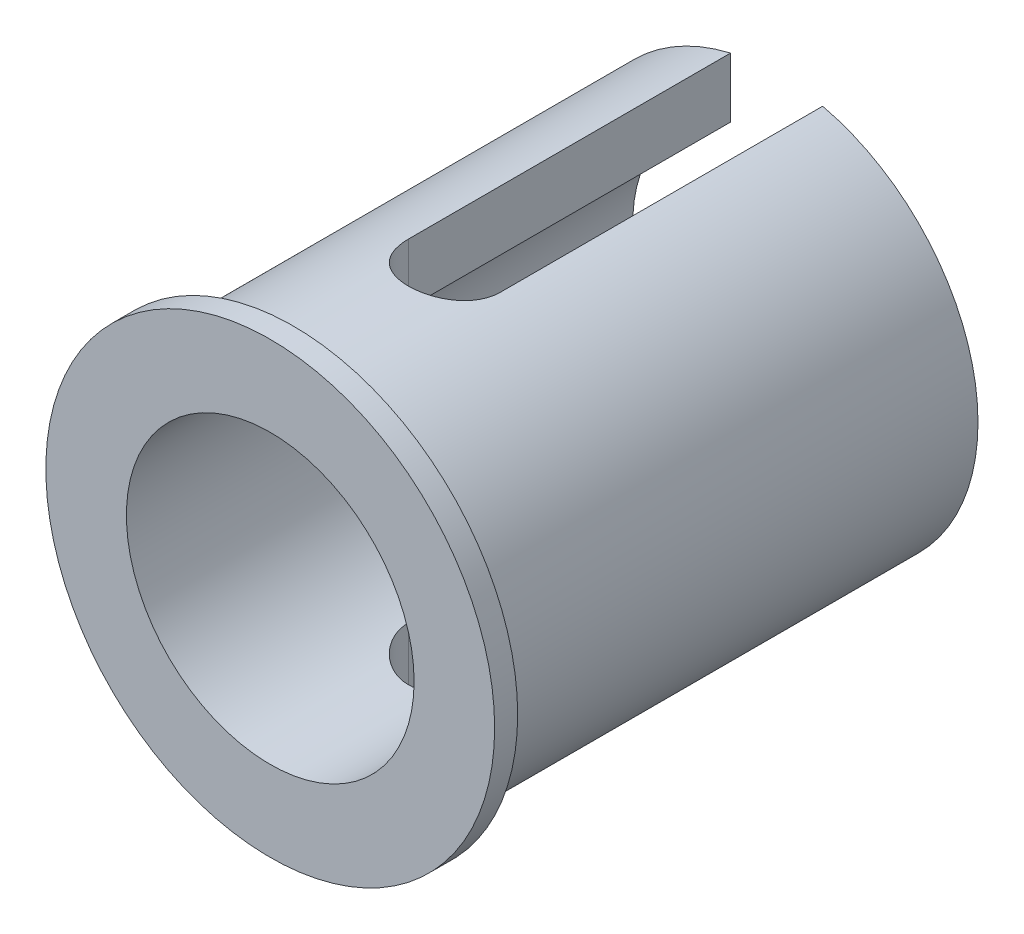
ISO-10303-21;
HEADER;
FILE_DESCRIPTION(('STEP AP214'),'2;1');
FILE_NAME('part.step','',(''),(''),'','','');
FILE_SCHEMA(('AUTOMOTIVE_DESIGN { 1 0 10303 214 1 1 1 1 }'));
ENDSEC;
DATA;
#1=APPLICATION_CONTEXT('core data for automotive mechanical design processes');
#2=APPLICATION_PROTOCOL_DEFINITION('international standard','automotive_design',2000,#1);
#3=PRODUCT_CONTEXT('',#1,'mechanical');
#4=PRODUCT('Part','Part','',(#3));
#5=PRODUCT_RELATED_PRODUCT_CATEGORY('part','',(#4));
#6=PRODUCT_DEFINITION_FORMATION('','',#4);
#7=PRODUCT_DEFINITION_CONTEXT('part definition',#1,'design');
#8=PRODUCT_DEFINITION('design','',#6,#7);
#9=PRODUCT_DEFINITION_SHAPE('','',#8);
#10=(LENGTH_UNIT() NAMED_UNIT(*) SI_UNIT(.MILLI.,.METRE.));
#11=(NAMED_UNIT(*) PLANE_ANGLE_UNIT() SI_UNIT($,.RADIAN.));
#12=(NAMED_UNIT(*) SI_UNIT($,.STERADIAN.) SOLID_ANGLE_UNIT());
#13=UNCERTAINTY_MEASURE_WITH_UNIT(LENGTH_MEASURE(1.E-05),#10,'distance_accuracy_value','');
#14=(GEOMETRIC_REPRESENTATION_CONTEXT(3) GLOBAL_UNCERTAINTY_ASSIGNED_CONTEXT((#13)) GLOBAL_UNIT_ASSIGNED_CONTEXT((#10,
#11,#12)) REPRESENTATION_CONTEXT('',''));
#15=CARTESIAN_POINT('',(0.,0.,0.));
#16=DIRECTION('',(0.,0.,1.));
#17=DIRECTION('',(1.,0.,0.));
#18=AXIS2_PLACEMENT_3D('',#15,#16,#17);
#19=CARTESIAN_POINT('',(0.,0.,-106.497474683058));
#20=DIRECTION('',(0.,0.,1.));
#21=DIRECTION('',(1.,0.,0.));
#22=AXIS2_PLACEMENT_3D('',#19,#20,#21);
#23=CYLINDRICAL_SURFACE('',#22,17.5);
#24=CARTESIAN_POINT('',(0.,0.,0.));
#25=DIRECTION('',(0.,0.,1.));
#26=DIRECTION('',(1.,0.,0.));
#27=AXIS2_PLACEMENT_3D('',#24,#25,#26);
#28=CIRCLE('',#27,17.5);
#29=CARTESIAN_POINT('',(17.5,0.,0.));
#30=VERTEX_POINT('',#29);
#31=EDGE_CURVE('E226',#30,#30,#28,.T.);
#32=ORIENTED_EDGE('',*,*,#31,.F.);
#33=EDGE_LOOP('',(#32));
#34=FACE_BOUND('',#33,.T.);
#35=CARTESIAN_POINT('',(4.,-17.0367250374008,-14.));
#36=CARTESIAN_POINT('',(4.00001248231752,-17.0367138660067,-13.8890681509802));
#37=CARTESIAN_POINT('',(3.99538546502867,-17.0378082617858,-13.7781434770407));
#38=CARTESIAN_POINT('',(3.97694932157873,-17.0421253952987,-13.5571174327618));
#39=CARTESIAN_POINT('',(3.96314155232038,-17.0453478185126,-13.4470159431883));
#40=CARTESIAN_POINT('',(3.92647318924765,-17.0538307536469,-13.2286052351257));
#41=CARTESIAN_POINT('',(3.90362864568809,-17.059087651771,-13.1202931917971));
#42=CARTESIAN_POINT('',(3.84909441070211,-17.0714746819689,-12.9060591164303));
#43=CARTESIAN_POINT('',(3.81740463706964,-17.0786048314525,-12.8001371066145));
#44=CARTESIAN_POINT('',(3.70940007909277,-17.1025105269156,-12.487064998065));
#45=CARTESIAN_POINT('',(3.6201165136919,-17.1218095761762,-12.2844107142015));
#46=CARTESIAN_POINT('',(3.40971418070429,-17.1649441397841,-11.8970188146421));
#47=CARTESIAN_POINT('',(3.28858925176469,-17.1887805318677,-11.7122846760033));
#48=CARTESIAN_POINT('',(3.01555269417647,-17.2387926899631,-11.3624938790227));
#49=CARTESIAN_POINT('',(2.8631677865296,-17.2650004661165,-11.1978105343623));
#50=CARTESIAN_POINT('',(2.53295238865314,-17.3165247611238,-10.8961004838254));
#51=CARTESIAN_POINT('',(2.35511790297881,-17.3418411392541,-10.759078128731));
#52=CARTESIAN_POINT('',(1.97651609742511,-17.3890809668325,-10.5150796799612));
#53=CARTESIAN_POINT('',(1.77550809318057,-17.410961949179,-10.4084680773347));
#54=CARTESIAN_POINT('',(1.35785483515843,-17.4484992744045,-10.2306870822243));
#55=CARTESIAN_POINT('',(1.14121231594596,-17.4641567027157,-10.1595115088972));
#56=CARTESIAN_POINT('',(0.702348968435731,-17.4872566687127,-10.0558050140799));
#57=CARTESIAN_POINT('',(0.480286158684646,-17.4948346770719,-10.0226360881499));
#58=CARTESIAN_POINT('',(0.0336222528298701,-17.5013922359856,-9.99388734164157));
#59=CARTESIAN_POINT('',(-0.19097858245641,-17.5003726621791,-9.99830369311109));
#60=CARTESIAN_POINT('',(-0.631926010215033,-17.489952340558,-10.0441310500121));
#61=CARTESIAN_POINT('',(-0.848348430712723,-17.4807076590668,-10.0848532048815));
#62=CARTESIAN_POINT('',(-1.27120201757732,-17.4550549045918,-10.2010359651051));
#63=CARTESIAN_POINT('',(-1.47763278775589,-17.4386465478123,-10.2764979467159));
#64=CARTESIAN_POINT('',(-1.87652973429281,-17.4002626903077,-10.460610280488));
#65=CARTESIAN_POINT('',(-2.06887311134545,-17.378244357821,-10.5695173599362));
#66=CARTESIAN_POINT('',(-2.43280009121923,-17.3310474587669,-10.8172430120138));
#67=CARTESIAN_POINT('',(-2.60438118822771,-17.3058685114888,-10.9560651895038));
#68=CARTESIAN_POINT('',(-2.92598580900956,-17.2544419046369,-11.2633581348487));
#69=CARTESIAN_POINT('',(-3.0754348941749,-17.2281829516239,-11.4324277375761));
#70=CARTESIAN_POINT('',(-3.34405202485233,-17.1780692090276,-11.7936653030108));
#71=CARTESIAN_POINT('',(-3.46321179425783,-17.1542150775981,-11.9858395576395));
#72=CARTESIAN_POINT('',(-3.61671597326182,-17.1222689727167,-12.2876218411558));
#73=CARTESIAN_POINT('',(-3.66376574815988,-17.1122387789592,-12.3907503245014));
#74=CARTESIAN_POINT('',(-3.7489839926838,-17.0937715302981,-12.6007382001695));
#75=CARTESIAN_POINT('',(-3.78715597297673,-17.0853338458964,-12.7075960984281));
#76=CARTESIAN_POINT('',(-3.8542742485837,-17.0703178704533,-12.9241673914184));
#77=CARTESIAN_POINT('',(-3.88323010403838,-17.0637376534167,-13.0338776985967));
#78=CARTESIAN_POINT('',(-3.93172314689819,-17.0526294698307,-13.2554190271487));
#79=CARTESIAN_POINT('',(-3.95126477595513,-17.0481005355421,-13.3672490225136));
#80=CARTESIAN_POINT('',(-3.97733749089981,-17.0420340571271,-13.5659970748536));
#81=CARTESIAN_POINT('',(-3.98583914323426,-17.0400453891908,-13.6526484373145));
#82=CARTESIAN_POINT('',(-3.99716769798061,-17.0373899876292,-13.8261972970282));
#83=CARTESIAN_POINT('',(-4.00000396405785,-17.0367210727584,-13.9130941500369));
#84=CARTESIAN_POINT('',(-4.,-17.0367250374008,-14.));
#85=B_SPLINE_CURVE_WITH_KNOTS('',3,(#35,#36,#37,#38,#39,#40,#41,#42,#43,#44,#45,#46,#47,#48,#49,
#50,#51,#52,#53,#54,#55,#56,#57,#58,#59,#60,#61,#62,#63,#64,#65,#66,#67,#68,#69,#70,#71,#72,#73,
#74,#75,#76,#77,#78,#79,#80,#81,#82,#83,#84),.UNSPECIFIED.,.F.,.F.,(4,2,2,2,2,2,2,2,2,2,2,2,2,2,
2,2,2,2,2,2,2,2,2,2,4),(0.,0.332681247866697,0.665313336820848,0.997357270100383,
1.32940428944207,1.99290262989595,2.65652945292504,3.33106339250549,4.00570334664101,
4.68811868485082,5.37041495269124,6.0410817607265,6.71168026410032,7.36981967360707,
8.02798515827642,8.69133469760162,9.35476421731794,10.0331782060872,10.7117773626502,
11.0528239514451,11.3937354453644,11.7342921410369,12.0746880036043,12.3357711604052,
12.5964224446493),.UNSPECIFIED.);
#86=CARTESIAN_POINT('',(4.,-17.0367250374008,-14.));
#87=VERTEX_POINT('',#86);
#88=CARTESIAN_POINT('',(-4.,-17.0367250374008,-14.));
#89=VERTEX_POINT('',#88);
#90=EDGE_CURVE('E134',#87,#89,#85,.T.);
#91=ORIENTED_EDGE('',*,*,#90,.F.);
#92=DIRECTION('',(0.,0.,1.));
#93=VECTOR('',#92,1.);
#94=CARTESIAN_POINT('',(3.99999999999999,-17.0367250374008,-106.497474683058));
#95=LINE('',#94,#93);
#96=CARTESIAN_POINT('',(4.,-17.0367250374008,-42.));
#97=VERTEX_POINT('',#96);
#98=EDGE_CURVE('E166',#87,#97,#95,.F.);
#99=ORIENTED_EDGE('',*,*,#98,.T.);
#100=CARTESIAN_POINT('',(0.,0.,-42.));
#101=DIRECTION('',(0.,0.,1.));
#102=DIRECTION('',(1.,0.,0.));
#103=AXIS2_PLACEMENT_3D('',#100,#101,#102);
#104=CIRCLE('',#103,17.5);
#105=CARTESIAN_POINT('',(4.,17.0367250374008,-42.));
#106=VERTEX_POINT('',#105);
#107=EDGE_CURVE('E239',#106,#97,#104,.F.);
#108=ORIENTED_EDGE('',*,*,#107,.F.);
#109=DIRECTION('',(0.,0.,1.));
#110=VECTOR('',#109,1.);
#111=CARTESIAN_POINT('',(3.99999999999999,17.0367250374008,-106.497474683058));
#112=LINE('',#111,#110);
#113=CARTESIAN_POINT('',(4.,17.0367250374008,-14.));
#114=VERTEX_POINT('',#113);
#115=EDGE_CURVE('E163',#106,#114,#112,.T.);
#116=ORIENTED_EDGE('',*,*,#115,.T.);
#117=CARTESIAN_POINT('',(-4.,17.0367250374008,-14.));
#118=CARTESIAN_POINT('',(-4.00001248231751,17.0367138660067,-13.8890681509802));
#119=CARTESIAN_POINT('',(-3.99538546502866,17.0378082617858,-13.7781434770407));
#120=CARTESIAN_POINT('',(-3.97694932157872,17.0421253952987,-13.5571174327618));
#121=CARTESIAN_POINT('',(-3.96314155232038,17.0453478185126,-13.4470159431883));
#122=CARTESIAN_POINT('',(-3.92647318924765,17.0538307536469,-13.2286052351257));
#123=CARTESIAN_POINT('',(-3.90362864568808,17.059087651771,-13.1202931917971));
#124=CARTESIAN_POINT('',(-3.8490944107021,17.0714746819689,-12.9060591164303));
#125=CARTESIAN_POINT('',(-3.81740463706963,17.0786048314525,-12.8001371066145));
#126=CARTESIAN_POINT('',(-3.70940007909276,17.1025105269156,-12.487064998065));
#127=CARTESIAN_POINT('',(-3.6201165136919,17.1218095761762,-12.2844107142015));
#128=CARTESIAN_POINT('',(-3.40971418070428,17.1649441397841,-11.8970188146421));
#129=CARTESIAN_POINT('',(-3.28858925176468,17.1887805318677,-11.7122846760033));
#130=CARTESIAN_POINT('',(-3.01555269417646,17.2387926899631,-11.3624938790227));
#131=CARTESIAN_POINT('',(-2.86316778652959,17.2650004661165,-11.1978105343623));
#132=CARTESIAN_POINT('',(-2.53295238865313,17.3165247611238,-10.8961004838254));
#133=CARTESIAN_POINT('',(-2.3551179029788,17.3418411392541,-10.759078128731));
#134=CARTESIAN_POINT('',(-1.97651609742511,17.3890809668325,-10.5150796799612));
#135=CARTESIAN_POINT('',(-1.77550809318057,17.410961949179,-10.4084680773347));
#136=CARTESIAN_POINT('',(-1.35785483515842,17.4484992744045,-10.2306870822243));
#137=CARTESIAN_POINT('',(-1.14121231594595,17.4641567027157,-10.1595115088972));
#138=CARTESIAN_POINT('',(-0.702348968435724,17.4872566687127,-10.0558050140799));
#139=CARTESIAN_POINT('',(-0.480286158684639,17.4948346770719,-10.0226360881499));
#140=CARTESIAN_POINT('',(-0.0336222528298628,17.5013922359856,-9.99388734164157));
#141=CARTESIAN_POINT('',(0.190978582456418,17.5003726621791,-9.99830369311109));
#142=CARTESIAN_POINT('',(0.63192601021504,17.489952340558,-10.0441310500121));
#143=CARTESIAN_POINT('',(0.84834843071273,17.4807076590668,-10.0848532048815));
#144=CARTESIAN_POINT('',(1.27120201757733,17.4550549045918,-10.2010359651051));
#145=CARTESIAN_POINT('',(1.4776327877559,17.4386465478123,-10.2764979467159));
#146=CARTESIAN_POINT('',(1.87652973429282,17.4002626903077,-10.460610280488));
#147=CARTESIAN_POINT('',(2.06887311134545,17.378244357821,-10.5695173599362));
#148=CARTESIAN_POINT('',(2.43280009121924,17.3310474587669,-10.8172430120138));
#149=CARTESIAN_POINT('',(2.60438118822771,17.3058685114888,-10.9560651895038));
#150=CARTESIAN_POINT('',(2.92598580900957,17.2544419046369,-11.2633581348487));
#151=CARTESIAN_POINT('',(3.07543489417491,17.2281829516239,-11.4324277375761));
#152=CARTESIAN_POINT('',(3.34405202485233,17.1780692090276,-11.7936653030108));
#153=CARTESIAN_POINT('',(3.46321179425784,17.1542150775981,-11.9858395576395));
#154=CARTESIAN_POINT('',(3.61671597326183,17.1222689727167,-12.2876218411558));
#155=CARTESIAN_POINT('',(3.66376574815989,17.1122387789592,-12.3907503245014));
#156=CARTESIAN_POINT('',(3.74898399268381,17.0937715302981,-12.6007382001695));
#157=CARTESIAN_POINT('',(3.78715597297674,17.0853338458964,-12.7075960984281));
#158=CARTESIAN_POINT('',(3.85427424858371,17.0703178704533,-12.9241673914184));
#159=CARTESIAN_POINT('',(3.88323010403838,17.0637376534167,-13.0338776985967));
#160=CARTESIAN_POINT('',(3.9317231468982,17.0526294698307,-13.2554190271487));
#161=CARTESIAN_POINT('',(3.95126477595514,17.0481005355421,-13.3672490225136));
#162=CARTESIAN_POINT('',(3.97733749089982,17.0420340571271,-13.5659970748536));
#163=CARTESIAN_POINT('',(3.98583914323427,17.0400453891908,-13.6526484373145));
#164=CARTESIAN_POINT('',(3.99716769798062,17.0373899876292,-13.8261972970282));
#165=CARTESIAN_POINT('',(4.00000396405785,17.0367210727584,-13.9130941500369));
#166=CARTESIAN_POINT('',(4.,17.0367250374008,-14.));
#167=B_SPLINE_CURVE_WITH_KNOTS('',3,(#117,#118,#119,#120,#121,#122,#123,#124,#125,#126,#127,
#128,#129,#130,#131,#132,#133,#134,#135,#136,#137,#138,#139,#140,#141,#142,#143,#144,#145,#146,
#147,#148,#149,#150,#151,#152,#153,#154,#155,#156,#157,#158,#159,#160,#161,#162,#163,#164,#165,
#166),.UNSPECIFIED.,.F.,.F.,(4,2,2,2,2,2,2,2,2,2,2,2,2,2,2,2,2,2,2,2,2,2,2,2,4),(0.,
0.332681247866697,0.66531333682085,0.997357270100387,1.32940428944207,1.99290262989595,
2.65652945292504,3.33106339250549,4.00570334664101,4.68811868485082,5.37041495269124,
6.0410817607265,6.71168026410032,7.36981967360707,8.02798515827642,8.69133469760162,
9.35476421731794,10.0331782060872,10.7117773626502,11.0528239514451,11.3937354453644,
11.7342921410368,12.0746880036043,12.3357711604052,12.5964224446493),.UNSPECIFIED.);
#168=CARTESIAN_POINT('',(-4.,17.0367250374008,-14.));
#169=VERTEX_POINT('',#168);
#170=EDGE_CURVE('E142',#169,#114,#167,.T.);
#171=ORIENTED_EDGE('',*,*,#170,.F.);
#172=DIRECTION('',(0.,0.,1.));
#173=VECTOR('',#172,1.);
#174=CARTESIAN_POINT('',(-4.00000000000001,17.0367250374008,-106.497474683058));
#175=LINE('',#174,#173);
#176=CARTESIAN_POINT('',(-4.,17.0367250374008,-42.));
#177=VERTEX_POINT('',#176);
#178=EDGE_CURVE('E155',#177,#169,#175,.T.);
#179=ORIENTED_EDGE('',*,*,#178,.F.);
#180=CARTESIAN_POINT('',(-4.,-17.0367250374008,-42.));
#181=VERTEX_POINT('',#180);
#182=EDGE_CURVE('E153',#181,#177,#104,.F.);
#183=ORIENTED_EDGE('',*,*,#182,.F.);
#184=DIRECTION('',(0.,0.,1.));
#185=VECTOR('',#184,1.);
#186=CARTESIAN_POINT('',(-4.00000000000001,-17.0367250374008,-106.497474683058));
#187=LINE('',#186,#185);
#188=EDGE_CURVE('E89',#89,#181,#187,.F.);
#189=ORIENTED_EDGE('',*,*,#188,.F.);
#190=EDGE_LOOP('',(#91,#99,#108,#116,#171,#179,#183,#189));
#191=FACE_BOUND('',#190,.T.);
#192=ADVANCED_FACE('F60',(#34,#191),#23,.T.);
#193=CARTESIAN_POINT('',(0.,0.,-106.497474683058));
#194=DIRECTION('',(0.,0.,1.));
#195=DIRECTION('',(1.,0.,0.));
#196=AXIS2_PLACEMENT_3D('',#193,#194,#195);
#197=CYLINDRICAL_SURFACE('',#196,12.5);
#198=CARTESIAN_POINT('',(0.,0.,2.));
#199=DIRECTION('',(0.,0.,1.));
#200=DIRECTION('',(1.,0.,0.));
#201=AXIS2_PLACEMENT_3D('',#198,#199,#200);
#202=CIRCLE('',#201,12.5);
#203=CARTESIAN_POINT('',(12.5,0.,2.));
#204=VERTEX_POINT('',#203);
#205=EDGE_CURVE('E228',#204,#204,#202,.T.);
#206=ORIENTED_EDGE('',*,*,#205,.T.);
#207=EDGE_LOOP('',(#206));
#208=FACE_BOUND('',#207,.T.);
#209=DIRECTION('',(0.,0.,1.));
#210=VECTOR('',#209,1.);
#211=CARTESIAN_POINT('',(3.99999999999999,-11.842719282327,-106.497474683058));
#212=LINE('',#211,#210);
#213=CARTESIAN_POINT('',(4.,-11.842719282327,-14.));
#214=VERTEX_POINT('',#213);
#215=CARTESIAN_POINT('',(4.,-11.842719282327,-42.));
#216=VERTEX_POINT('',#215);
#217=EDGE_CURVE('E157',#214,#216,#212,.F.);
#218=ORIENTED_EDGE('',*,*,#217,.F.);
#219=CARTESIAN_POINT('',(4.,-11.842719282327,-14.));
#220=CARTESIAN_POINT('',(4.00001410484614,-11.8427027366058,-13.8906002280384));
#221=CARTESIAN_POINT('',(3.995512175201,-11.8442348052368,-13.7812097901521));
#222=CARTESIAN_POINT('',(3.9775860667845,-11.8502730910574,-13.5632717592635));
#223=CARTESIAN_POINT('',(3.96416412872571,-11.8547785613244,-13.4547239615155));
#224=CARTESIAN_POINT('',(3.9285572511943,-11.8666242076309,-13.2395389691545));
#225=CARTESIAN_POINT('',(3.90639676021451,-11.8739564736691,-13.1328973043888));
#226=CARTESIAN_POINT('',(3.85353581488657,-11.8912164993788,-12.9219943616284));
#227=CARTESIAN_POINT('',(3.82283508754056,-11.90114434202,-12.8177331598432));
#228=CARTESIAN_POINT('',(3.71831764495513,-11.9343840843196,-12.5096949957216));
#229=CARTESIAN_POINT('',(3.63203544139888,-11.9611699822066,-12.310363447932));
#230=CARTESIAN_POINT('',(3.42895021192288,-12.0209583955878,-11.9289874429582));
#231=CARTESIAN_POINT('',(3.3121303092491,-12.0539643457894,-11.7469526209503));
#232=CARTESIAN_POINT('',(3.0467850788479,-12.123798407807,-11.3987460114008));
#233=CARTESIAN_POINT('',(2.89735303896515,-12.1607158548651,-11.2332816756605));
#234=CARTESIAN_POINT('',(2.57296449846116,-12.2334561140966,-10.9292851514111));
#235=CARTESIAN_POINT('',(2.39800356343233,-12.2692787347869,-10.7907576516423));
#236=CARTESIAN_POINT('',(2.02237003010512,-12.3368244653945,-10.5413848016295));
#237=CARTESIAN_POINT('',(1.82118394546976,-12.3684294972003,-10.4312780435304));
#238=CARTESIAN_POINT('',(1.40197197350369,-12.4229251649937,-10.2467505046506));
#239=CARTESIAN_POINT('',(1.18395091903581,-12.4458182908278,-10.1723195262181));
#240=CARTESIAN_POINT('',(0.744713961063367,-12.4796767811416,-10.0636411357495));
#241=CARTESIAN_POINT('',(0.523827920101157,-12.4910030499338,-10.0281750666199));
#242=CARTESIAN_POINT('',(0.07896481517464,-12.5017287122873,-9.99456720095836));
#243=CARTESIAN_POINT('',(-0.145011564197639,-12.5011307063103,-9.99641726647516));
#244=CARTESIAN_POINT('',(-0.581094974437689,-12.4883236673358,-10.0365988292713));
#245=CARTESIAN_POINT('',(-0.793338226675235,-12.4765355800409,-10.0736077679788));
#246=CARTESIAN_POINT('',(-1.2084232001272,-12.443194578958,-10.1808805516063));
#247=CARTESIAN_POINT('',(-1.41126440871778,-12.4216411334261,-10.2511462074328));
#248=CARTESIAN_POINT('',(-1.80478548808183,-12.3706364987475,-10.4237578422358));
#249=CARTESIAN_POINT('',(-1.99528012693527,-12.3410893067347,-10.5264965198688));
#250=CARTESIAN_POINT('',(-2.35673113106228,-12.2771965403044,-10.7608290490452));
#251=CARTESIAN_POINT('',(-2.5276825327575,-12.2428497517893,-10.892430206403));
#252=CARTESIAN_POINT('',(-2.8530451152822,-12.1712409097156,-11.1874465312916));
#253=CARTESIAN_POINT('',(-3.00641313381737,-12.1339170352569,-11.3519967025921));
#254=CARTESIAN_POINT('',(-3.28377291775701,-12.0618172896256,-11.7049719000853));
#255=CARTESIAN_POINT('',(-3.40775562728565,-12.0270422062066,-11.8934042588322));
#256=CARTESIAN_POINT('',(-3.56958208232606,-11.9796198433082,-12.1913712377486));
#257=CARTESIAN_POINT('',(-3.61975674493765,-11.9645161845072,-12.2939990592415));
#258=CARTESIAN_POINT('',(-3.71123075156255,-11.9364591580623,-12.5034047527517));
#259=CARTESIAN_POINT('',(-3.75253376401034,-11.9235049021446,-12.6101808877864));
#260=CARTESIAN_POINT('',(-3.82585831579178,-11.9001802342949,-12.8270133278916));
#261=CARTESIAN_POINT('',(-3.85788979915528,-11.889807055759,-12.9370659779731));
#262=CARTESIAN_POINT('',(-3.91241790563964,-11.8719756673203,-13.1596951569476));
#263=CARTESIAN_POINT('',(-3.93491889994975,-11.8645161211931,-13.2722705037974));
#264=CARTESIAN_POINT('',(-3.96832908530803,-11.8533815888388,-13.487239245861));
#265=CARTESIAN_POINT('',(-3.9802038456482,-11.8493925948395,-13.5894674157946));
#266=CARTESIAN_POINT('',(-3.9960393712768,-11.8440568016292,-13.7944610780333));
#267=CARTESIAN_POINT('',(-4.00001099551563,-11.8427063770563,-13.8972256382805));
#268=CARTESIAN_POINT('',(-4.,-11.842719282327,-14.));
#269=B_SPLINE_CURVE_WITH_KNOTS('',3,(#219,#220,#221,#222,#223,#224,#225,#226,#227,#228,#229,
#230,#231,#232,#233,#234,#235,#236,#237,#238,#239,#240,#241,#242,#243,#244,#245,#246,#247,#248,
#249,#250,#251,#252,#253,#254,#255,#256,#257,#258,#259,#260,#261,#262,#263,#264,#265,#266,#267,
#268),.UNSPECIFIED.,.F.,.F.,(4,2,2,2,2,2,2,2,2,2,2,2,2,2,2,2,2,2,2,2,2,2,2,2,4),(0.,
0.328080176984102,0.656077971124948,0.983164539368218,1.310261564488,1.96355293984248,
2.61720612481382,3.29209427898756,3.96709980211697,4.65819584662374,5.34909422856993,
6.01770820975086,6.68617638029994,7.3304550155383,7.97476873730065,8.62719320105811,
9.27978300073407,9.96076419384898,10.6419549776068,10.9872862883783,11.3324745283028,
11.6772911585126,12.0219494657669,12.3305938648259,12.6388138912331),.UNSPECIFIED.);
#270=CARTESIAN_POINT('',(-4.,-11.842719282327,-14.));
#271=VERTEX_POINT('',#270);
#272=EDGE_CURVE('E14',#214,#271,#269,.T.);
#273=ORIENTED_EDGE('',*,*,#272,.T.);
#274=DIRECTION('',(0.,0.,1.));
#275=VECTOR('',#274,1.);
#276=CARTESIAN_POINT('',(-4.00000000000001,-11.842719282327,-106.497474683058));
#277=LINE('',#276,#275);
#278=CARTESIAN_POINT('',(-4.,-11.842719282327,-42.));
#279=VERTEX_POINT('',#278);
#280=EDGE_CURVE('E146',#271,#279,#277,.F.);
#281=ORIENTED_EDGE('',*,*,#280,.T.);
#282=CARTESIAN_POINT('',(0.,0.,-42.));
#283=DIRECTION('',(0.,0.,1.));
#284=DIRECTION('',(1.,0.,0.));
#285=AXIS2_PLACEMENT_3D('',#282,#283,#284);
#286=CIRCLE('',#285,12.5);
#287=CARTESIAN_POINT('',(-4.,11.842719282327,-42.));
#288=VERTEX_POINT('',#287);
#289=EDGE_CURVE('E238',#279,#288,#286,.F.);
#290=ORIENTED_EDGE('',*,*,#289,.T.);
#291=DIRECTION('',(0.,0.,1.));
#292=VECTOR('',#291,1.);
#293=CARTESIAN_POINT('',(-4.00000000000001,11.842719282327,-106.497474683058));
#294=LINE('',#293,#292);
#295=CARTESIAN_POINT('',(-4.,11.842719282327,-14.));
#296=VERTEX_POINT('',#295);
#297=EDGE_CURVE('E81',#288,#296,#294,.T.);
#298=ORIENTED_EDGE('',*,*,#297,.T.);
#299=CARTESIAN_POINT('',(-4.,11.842719282327,-14.));
#300=CARTESIAN_POINT('',(-4.00001410484613,11.8427027366058,-13.8906002280384));
#301=CARTESIAN_POINT('',(-3.995512175201,11.8442348052368,-13.7812097901521));
#302=CARTESIAN_POINT('',(-3.97758606678449,11.8502730910574,-13.5632717592635));
#303=CARTESIAN_POINT('',(-3.96416412872571,11.8547785613244,-13.4547239615155));
#304=CARTESIAN_POINT('',(-3.92855725119429,11.8666242076309,-13.2395389691545));
#305=CARTESIAN_POINT('',(-3.9063967602145,11.8739564736691,-13.1328973043888));
#306=CARTESIAN_POINT('',(-3.85353581488656,11.8912164993788,-12.9219943616284));
#307=CARTESIAN_POINT('',(-3.82283508754056,11.90114434202,-12.8177331598432));
#308=CARTESIAN_POINT('',(-3.71831764495512,11.9343840843196,-12.5096949957216));
#309=CARTESIAN_POINT('',(-3.63203544139887,11.9611699822066,-12.310363447932));
#310=CARTESIAN_POINT('',(-3.42895021192288,12.0209583955878,-11.9289874429582));
#311=CARTESIAN_POINT('',(-3.31213030924909,12.0539643457894,-11.7469526209503));
#312=CARTESIAN_POINT('',(-3.0467850788479,12.123798407807,-11.3987460114008));
#313=CARTESIAN_POINT('',(-2.89735303896514,12.1607158548651,-11.2332816756605));
#314=CARTESIAN_POINT('',(-2.57296449846116,12.2334561140966,-10.9292851514111));
#315=CARTESIAN_POINT('',(-2.39800356343232,12.2692787347869,-10.7907576516423));
#316=CARTESIAN_POINT('',(-2.02237003010511,12.3368244653945,-10.5413848016295));
#317=CARTESIAN_POINT('',(-1.82118394546976,12.3684294972003,-10.4312780435304));
#318=CARTESIAN_POINT('',(-1.40197197350368,12.4229251649937,-10.2467505046506));
#319=CARTESIAN_POINT('',(-1.1839509190358,12.4458182908278,-10.1723195262181));
#320=CARTESIAN_POINT('',(-0.74471396106336,12.4796767811416,-10.0636411357495));
#321=CARTESIAN_POINT('',(-0.523827920101151,12.4910030499338,-10.0281750666199));
#322=CARTESIAN_POINT('',(-0.0789648151746335,12.5017287122873,-9.99456720095836));
#323=CARTESIAN_POINT('',(0.145011564197646,12.5011307063103,-9.99641726647516));
#324=CARTESIAN_POINT('',(0.581094974437696,12.4883236673358,-10.0365988292713));
#325=CARTESIAN_POINT('',(0.793338226675243,12.4765355800409,-10.0736077679788));
#326=CARTESIAN_POINT('',(1.20842320012721,12.443194578958,-10.1808805516063));
#327=CARTESIAN_POINT('',(1.41126440871778,12.4216411334261,-10.2511462074328));
#328=CARTESIAN_POINT('',(1.80478548808183,12.3706364987475,-10.4237578422358));
#329=CARTESIAN_POINT('',(1.99528012693527,12.3410893067347,-10.5264965198688));
#330=CARTESIAN_POINT('',(2.35673113106229,12.2771965403044,-10.7608290490452));
#331=CARTESIAN_POINT('',(2.52768253275751,12.2428497517893,-10.892430206403));
#332=CARTESIAN_POINT('',(2.85304511528221,12.1712409097156,-11.1874465312916));
#333=CARTESIAN_POINT('',(3.00641313381738,12.1339170352569,-11.3519967025921));
#334=CARTESIAN_POINT('',(3.28377291775702,12.0618172896256,-11.7049719000853));
#335=CARTESIAN_POINT('',(3.40775562728566,12.0270422062066,-11.8934042588322));
#336=CARTESIAN_POINT('',(3.56958208232607,11.9796198433082,-12.1913712377486));
#337=CARTESIAN_POINT('',(3.61975674493765,11.9645161845072,-12.2939990592415));
#338=CARTESIAN_POINT('',(3.71123075156256,11.9364591580623,-12.5034047527517));
#339=CARTESIAN_POINT('',(3.75253376401034,11.9235049021446,-12.6101808877864));
#340=CARTESIAN_POINT('',(3.82585831579179,11.9001802342949,-12.8270133278916));
#341=CARTESIAN_POINT('',(3.85788979915529,11.889807055759,-12.9370659779731));
#342=CARTESIAN_POINT('',(3.91241790563964,11.8719756673203,-13.1596951569476));
#343=CARTESIAN_POINT('',(3.93491889994976,11.8645161211931,-13.2722705037974));
#344=CARTESIAN_POINT('',(3.96832908530804,11.8533815888388,-13.487239245861));
#345=CARTESIAN_POINT('',(3.9802038456482,11.8493925948395,-13.5894674157946));
#346=CARTESIAN_POINT('',(3.99603937127681,11.8440568016292,-13.7944610780333));
#347=CARTESIAN_POINT('',(4.00001099551564,11.8427063770563,-13.8972256382805));
#348=CARTESIAN_POINT('',(4.,11.842719282327,-14.));
#349=B_SPLINE_CURVE_WITH_KNOTS('',3,(#299,#300,#301,#302,#303,#304,#305,#306,#307,#308,#309,
#310,#311,#312,#313,#314,#315,#316,#317,#318,#319,#320,#321,#322,#323,#324,#325,#326,#327,#328,
#329,#330,#331,#332,#333,#334,#335,#336,#337,#338,#339,#340,#341,#342,#343,#344,#345,#346,#347,
#348),.UNSPECIFIED.,.F.,.F.,(4,2,2,2,2,2,2,2,2,2,2,2,2,2,2,2,2,2,2,2,2,2,2,2,4),(0.,
0.328080176984102,0.656077971124948,0.983164539368217,1.310261564488,1.96355293984248,
2.61720612481382,3.29209427898756,3.96709980211697,4.65819584662374,5.34909422856993,
6.01770820975086,6.68617638029994,7.3304550155383,7.97476873730065,8.62719320105811,
9.27978300073407,9.96076419384898,10.6419549776068,10.9872862883783,11.3324745283028,
11.6772911585126,12.0219494657669,12.3305938648259,12.6388138912331),.UNSPECIFIED.);
#350=CARTESIAN_POINT('',(4.,11.842719282327,-14.));
#351=VERTEX_POINT('',#350);
#352=EDGE_CURVE('E74',#296,#351,#349,.T.);
#353=ORIENTED_EDGE('',*,*,#352,.T.);
#354=DIRECTION('',(0.,0.,1.));
#355=VECTOR('',#354,1.);
#356=CARTESIAN_POINT('',(3.99999999999999,11.842719282327,-106.497474683058));
#357=LINE('',#356,#355);
#358=CARTESIAN_POINT('',(4.,11.842719282327,-42.));
#359=VERTEX_POINT('',#358);
#360=EDGE_CURVE('E154',#359,#351,#357,.T.);
#361=ORIENTED_EDGE('',*,*,#360,.F.);
#362=EDGE_CURVE('E235',#359,#216,#286,.F.);
#363=ORIENTED_EDGE('',*,*,#362,.T.);
#364=EDGE_LOOP('',(#218,#273,#281,#290,#298,#353,#361,#363));
#365=FACE_BOUND('',#364,.T.);
#366=ADVANCED_FACE('F197',(#208,#365),#197,.F.);
#367=CARTESIAN_POINT('',(0.,0.,-42.));
#368=DIRECTION('',(0.,0.,1.));
#369=DIRECTION('',(1.,0.,0.));
#370=AXIS2_PLACEMENT_3D('',#367,#368,#369);
#371=PLANE('',#370);
#372=DIRECTION('',(0.,-1.,0.));
#373=VECTOR('',#372,1.);
#374=CARTESIAN_POINT('',(4.,0.,-42.));
#375=LINE('',#374,#373);
#376=EDGE_CURVE('E194',#106,#359,#375,.T.);
#377=ORIENTED_EDGE('',*,*,#376,.F.);
#378=ORIENTED_EDGE('',*,*,#107,.T.);
#379=EDGE_CURVE('E195',#216,#97,#375,.T.);
#380=ORIENTED_EDGE('',*,*,#379,.F.);
#381=ORIENTED_EDGE('',*,*,#362,.F.);
#382=EDGE_LOOP('',(#377,#378,#380,#381));
#383=FACE_BOUND('',#382,.T.);
#384=ADVANCED_FACE('F201',(#383),#371,.F.);
#385=ORIENTED_EDGE('',*,*,#182,.T.);
#386=DIRECTION('',(0.,-1.,0.));
#387=VECTOR('',#386,1.);
#388=CARTESIAN_POINT('',(-4.,0.,-42.));
#389=LINE('',#388,#387);
#390=EDGE_CURVE('E242',#177,#288,#389,.T.);
#391=ORIENTED_EDGE('',*,*,#390,.T.);
#392=ORIENTED_EDGE('',*,*,#289,.F.);
#393=EDGE_CURVE('E241',#279,#181,#389,.T.);
#394=ORIENTED_EDGE('',*,*,#393,.T.);
#395=EDGE_LOOP('',(#385,#391,#392,#394));
#396=FACE_BOUND('',#395,.T.);
#397=ADVANCED_FACE('F62',(#396),#371,.F.);
#398=CARTESIAN_POINT('',(0.,0.,2.));
#399=DIRECTION('',(0.,0.,1.));
#400=DIRECTION('',(1.,0.,0.));
#401=AXIS2_PLACEMENT_3D('',#398,#399,#400);
#402=PLANE('',#401);
#403=ORIENTED_EDGE('',*,*,#205,.F.);
#404=EDGE_LOOP('',(#403));
#405=FACE_BOUND('',#404,.T.);
#406=CARTESIAN_POINT('',(0.,0.,2.));
#407=DIRECTION('',(0.,0.,1.));
#408=DIRECTION('',(1.,0.,0.));
#409=AXIS2_PLACEMENT_3D('',#406,#407,#408);
#410=CIRCLE('',#409,19.5);
#411=CARTESIAN_POINT('',(19.5,0.,2.));
#412=VERTEX_POINT('',#411);
#413=EDGE_CURVE('E141',#412,#412,#410,.T.);
#414=ORIENTED_EDGE('',*,*,#413,.T.);
#415=EDGE_LOOP('',(#414));
#416=FACE_BOUND('',#415,.T.);
#417=ADVANCED_FACE('F203',(#405,#416),#402,.T.);
#418=CARTESIAN_POINT('',(0.,0.,-55.1543289325507));
#419=DIRECTION('',(0.,0.,1.));
#420=DIRECTION('',(1.,0.,0.));
#421=AXIS2_PLACEMENT_3D('',#418,#419,#420);
#422=CYLINDRICAL_SURFACE('',#421,19.5);
#423=CARTESIAN_POINT('',(0.,0.,0.));
#424=DIRECTION('',(0.,0.,1.));
#425=DIRECTION('',(1.,0.,0.));
#426=AXIS2_PLACEMENT_3D('',#423,#424,#425);
#427=CIRCLE('',#426,19.5);
#428=CARTESIAN_POINT('',(19.5,0.,0.));
#429=VERTEX_POINT('',#428);
#430=EDGE_CURVE('E227',#429,#429,#427,.F.);
#431=ORIENTED_EDGE('',*,*,#430,.F.);
#432=EDGE_LOOP('',(#431));
#433=FACE_BOUND('',#432,.T.);
#434=ORIENTED_EDGE('',*,*,#413,.F.);
#435=EDGE_LOOP('',(#434));
#436=FACE_BOUND('',#435,.T.);
#437=ADVANCED_FACE('F207',(#433,#436),#422,.T.);
#438=CARTESIAN_POINT('',(0.,0.,0.));
#439=DIRECTION('',(0.,0.,1.));
#440=DIRECTION('',(1.,0.,0.));
#441=AXIS2_PLACEMENT_3D('',#438,#439,#440);
#442=PLANE('',#441);
#443=ORIENTED_EDGE('',*,*,#430,.T.);
#444=EDGE_LOOP('',(#443));
#445=FACE_BOUND('',#444,.T.);
#446=ORIENTED_EDGE('',*,*,#31,.T.);
#447=EDGE_LOOP('',(#446));
#448=FACE_BOUND('',#447,.T.);
#449=ADVANCED_FACE('F210',(#445,#448),#442,.F.);
#450=CARTESIAN_POINT('',(-4.,-19.5,-42.));
#451=DIRECTION('',(-1.,0.,0.));
#452=DIRECTION('',(0.,0.,1.));
#453=AXIS2_PLACEMENT_3D('',#450,#451,#452);
#454=PLANE('',#453);
#455=ORIENTED_EDGE('',*,*,#188,.T.);
#456=ORIENTED_EDGE('',*,*,#393,.F.);
#457=ORIENTED_EDGE('',*,*,#280,.F.);
#458=DIRECTION('',(0.,1.,0.));
#459=VECTOR('',#458,1.);
#460=CARTESIAN_POINT('',(-4.,-19.5,-14.));
#461=LINE('',#460,#459);
#462=EDGE_CURVE('E136',#89,#271,#461,.T.);
#463=ORIENTED_EDGE('',*,*,#462,.F.);
#464=EDGE_LOOP('',(#455,#456,#457,#463));
#465=FACE_BOUND('',#464,.T.);
#466=ADVANCED_FACE('F144',(#465),#454,.F.);
#467=CARTESIAN_POINT('',(4.,-19.5,-42.));
#468=DIRECTION('',(-1.,0.,0.));
#469=DIRECTION('',(0.,0.,1.));
#470=AXIS2_PLACEMENT_3D('',#467,#468,#469);
#471=PLANE('',#470);
#472=DIRECTION('',(0.,1.,0.));
#473=VECTOR('',#472,1.);
#474=CARTESIAN_POINT('',(4.,-19.5,-14.));
#475=LINE('',#474,#473);
#476=EDGE_CURVE('E138',#87,#214,#475,.T.);
#477=ORIENTED_EDGE('',*,*,#476,.T.);
#478=ORIENTED_EDGE('',*,*,#217,.T.);
#479=ORIENTED_EDGE('',*,*,#379,.T.);
#480=ORIENTED_EDGE('',*,*,#98,.F.);
#481=EDGE_LOOP('',(#477,#478,#479,#480));
#482=FACE_BOUND('',#481,.T.);
#483=ADVANCED_FACE('F183',(#482),#471,.T.);
#484=CARTESIAN_POINT('',(0.,-19.5,-14.));
#485=DIRECTION('',(0.,1.,0.));
#486=DIRECTION('',(0.,0.,1.));
#487=AXIS2_PLACEMENT_3D('',#484,#485,#486);
#488=CYLINDRICAL_SURFACE('',#487,4.);
#489=ORIENTED_EDGE('',*,*,#90,.T.);
#490=ORIENTED_EDGE('',*,*,#462,.T.);
#491=ORIENTED_EDGE('',*,*,#272,.F.);
#492=ORIENTED_EDGE('',*,*,#476,.F.);
#493=EDGE_LOOP('',(#489,#490,#491,#492));
#494=FACE_BOUND('',#493,.T.);
#495=ADVANCED_FACE('F135',(#494),#488,.F.);
#496=ORIENTED_EDGE('',*,*,#170,.T.);
#497=EDGE_CURVE('E147',#351,#114,#475,.T.);
#498=ORIENTED_EDGE('',*,*,#497,.F.);
#499=ORIENTED_EDGE('',*,*,#352,.F.);
#500=EDGE_CURVE('E148',#296,#169,#461,.T.);
#501=ORIENTED_EDGE('',*,*,#500,.T.);
#502=EDGE_LOOP('',(#496,#498,#499,#501));
#503=FACE_BOUND('',#502,.T.);
#504=ADVANCED_FACE('F182',(#503),#488,.F.);
#505=ORIENTED_EDGE('',*,*,#376,.T.);
#506=ORIENTED_EDGE('',*,*,#360,.T.);
#507=ORIENTED_EDGE('',*,*,#497,.T.);
#508=ORIENTED_EDGE('',*,*,#115,.F.);
#509=EDGE_LOOP('',(#505,#506,#507,#508));
#510=FACE_BOUND('',#509,.T.);
#511=ADVANCED_FACE('F261',(#510),#471,.T.);
#512=ORIENTED_EDGE('',*,*,#178,.T.);
#513=ORIENTED_EDGE('',*,*,#500,.F.);
#514=ORIENTED_EDGE('',*,*,#297,.F.);
#515=ORIENTED_EDGE('',*,*,#390,.F.);
#516=EDGE_LOOP('',(#512,#513,#514,#515));
#517=FACE_BOUND('',#516,.T.);
#518=ADVANCED_FACE('F217',(#517),#454,.F.);
#519=CLOSED_SHELL('',(#192,#366,#384,#397,#417,#437,#449,#466,#483,#495,#504,#511,#518));
#520=MANIFOLD_SOLID_BREP('B2',#519);
#521=ADVANCED_BREP_SHAPE_REPRESENTATION('',(#18,#520),#14);
#522=SHAPE_DEFINITION_REPRESENTATION(#9,#521);
ENDSEC;
END-ISO-10303-21;
